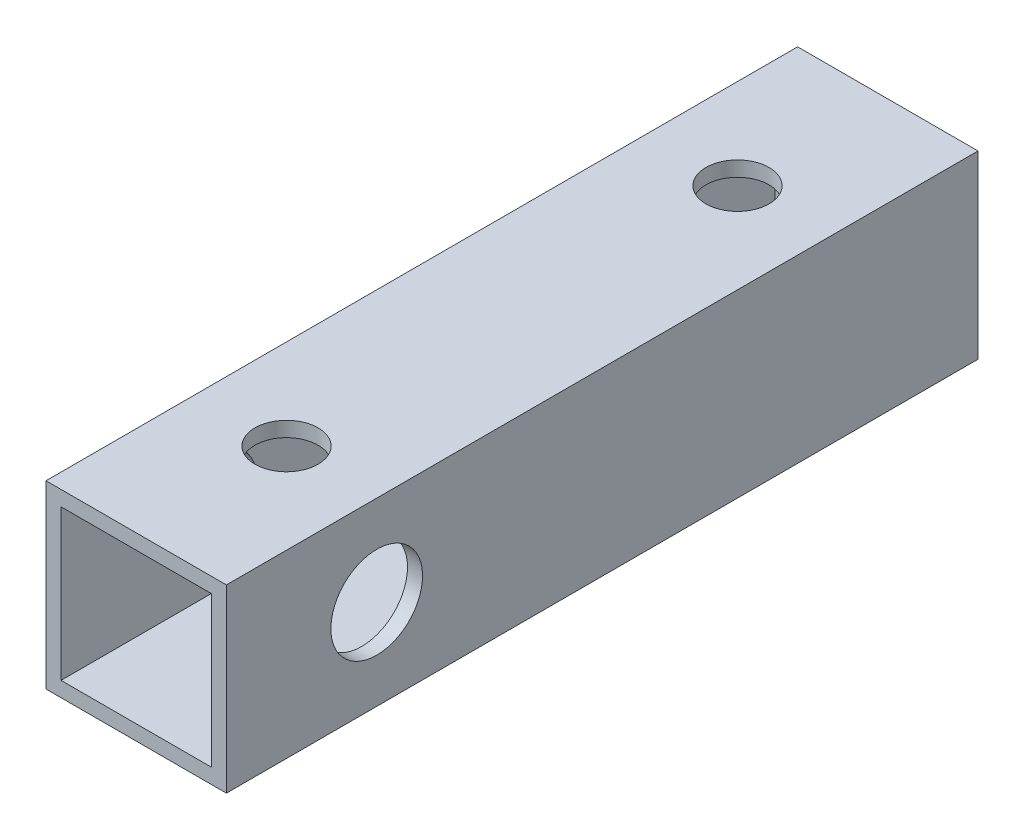
ISO-10303-21;
HEADER;
FILE_DESCRIPTION(('STEP AP214'),'2;1');
FILE_NAME('part.step','',(''),(''),'','','');
FILE_SCHEMA(('AUTOMOTIVE_DESIGN { 1 0 10303 214 1 1 1 1 }'));
ENDSEC;
DATA;
#1=APPLICATION_CONTEXT('core data for automotive mechanical design processes');
#2=APPLICATION_PROTOCOL_DEFINITION('international standard','automotive_design',2000,#1);
#3=PRODUCT_CONTEXT('',#1,'mechanical');
#4=PRODUCT('Part','Part','',(#3));
#5=PRODUCT_RELATED_PRODUCT_CATEGORY('part','',(#4));
#6=PRODUCT_DEFINITION_FORMATION('','',#4);
#7=PRODUCT_DEFINITION_CONTEXT('part definition',#1,'design');
#8=PRODUCT_DEFINITION('design','',#6,#7);
#9=PRODUCT_DEFINITION_SHAPE('','',#8);
#10=(LENGTH_UNIT() NAMED_UNIT(*) SI_UNIT(.MILLI.,.METRE.));
#11=(NAMED_UNIT(*) PLANE_ANGLE_UNIT() SI_UNIT($,.RADIAN.));
#12=(NAMED_UNIT(*) SI_UNIT($,.STERADIAN.) SOLID_ANGLE_UNIT());
#13=UNCERTAINTY_MEASURE_WITH_UNIT(LENGTH_MEASURE(1.E-05),#10,'distance_accuracy_value','');
#14=(GEOMETRIC_REPRESENTATION_CONTEXT(3) GLOBAL_UNCERTAINTY_ASSIGNED_CONTEXT((#13)) GLOBAL_UNIT_ASSIGNED_CONTEXT((#10,
#11,#12)) REPRESENTATION_CONTEXT('',''));
#15=CARTESIAN_POINT('',(0.,0.,0.));
#16=DIRECTION('',(0.,0.,1.));
#17=DIRECTION('',(1.,0.,0.));
#18=AXIS2_PLACEMENT_3D('',#15,#16,#17);
#19=CARTESIAN_POINT('',(6.,6.,50.));
#20=DIRECTION('',(-1.,0.,0.));
#21=DIRECTION('',(0.,-1.,0.));
#22=AXIS2_PLACEMENT_3D('',#19,#20,#21);
#23=PLANE('',#22);
#24=CARTESIAN_POINT('',(6.,0.,40.));
#25=DIRECTION('',(-1.,0.,0.));
#26=DIRECTION('',(0.,-1.,0.));
#27=AXIS2_PLACEMENT_3D('',#24,#25,#26);
#28=CIRCLE('',#27,3.05);
#29=CARTESIAN_POINT('',(6.,-3.05,40.));
#30=VERTEX_POINT('',#29);
#31=EDGE_CURVE('E190',#30,#30,#28,.T.);
#32=ORIENTED_EDGE('',*,*,#31,.T.);
#33=EDGE_LOOP('',(#32));
#34=FACE_BOUND('',#33,.T.);
#35=DIRECTION('',(0.,1.,0.));
#36=VECTOR('',#35,1.);
#37=CARTESIAN_POINT('',(6.,6.,0.));
#38=LINE('',#37,#36);
#39=CARTESIAN_POINT('',(6.,-6.,0.));
#40=VERTEX_POINT('',#39);
#41=CARTESIAN_POINT('',(6.,6.,0.));
#42=VERTEX_POINT('',#41);
#43=EDGE_CURVE('E146',#40,#42,#38,.T.);
#44=ORIENTED_EDGE('',*,*,#43,.T.);
#45=DIRECTION('',(0.,0.,-1.));
#46=VECTOR('',#45,1.);
#47=CARTESIAN_POINT('',(6.,6.,50.));
#48=LINE('',#47,#46);
#49=CARTESIAN_POINT('',(6.,6.,50.));
#50=VERTEX_POINT('',#49);
#51=EDGE_CURVE('E11',#50,#42,#48,.T.);
#52=ORIENTED_EDGE('',*,*,#51,.F.);
#53=DIRECTION('',(0.,1.,0.));
#54=VECTOR('',#53,1.);
#55=CARTESIAN_POINT('',(6.,6.,50.));
#56=LINE('',#55,#54);
#57=CARTESIAN_POINT('',(6.,-6.,50.));
#58=VERTEX_POINT('',#57);
#59=EDGE_CURVE('E150',#58,#50,#56,.T.);
#60=ORIENTED_EDGE('',*,*,#59,.F.);
#61=DIRECTION('',(0.,0.,-1.));
#62=VECTOR('',#61,1.);
#63=CARTESIAN_POINT('',(6.,-6.,50.));
#64=LINE('',#63,#62);
#65=EDGE_CURVE('E156',#58,#40,#64,.T.);
#66=ORIENTED_EDGE('',*,*,#65,.T.);
#67=EDGE_LOOP('',(#44,#52,#60,#66));
#68=FACE_BOUND('',#67,.T.);
#69=ADVANCED_FACE('F33',(#34,#68),#23,.F.);
#70=CARTESIAN_POINT('',(-6.,6.,50.));
#71=DIRECTION('',(0.,-1.,0.));
#72=DIRECTION('',(0.,0.,-1.));
#73=AXIS2_PLACEMENT_3D('',#70,#71,#72);
#74=PLANE('',#73);
#75=CARTESIAN_POINT('',(0.,6.,10.));
#76=DIRECTION('',(0.,1.,0.));
#77=DIRECTION('',(0.,0.,1.));
#78=AXIS2_PLACEMENT_3D('',#75,#76,#77);
#79=CIRCLE('',#78,2.1);
#80=CARTESIAN_POINT('',(0.,6.,12.1));
#81=VERTEX_POINT('',#80);
#82=EDGE_CURVE('E172',#81,#81,#79,.T.);
#83=ORIENTED_EDGE('',*,*,#82,.F.);
#84=EDGE_LOOP('',(#83));
#85=FACE_BOUND('',#84,.T.);
#86=CARTESIAN_POINT('',(0.,6.,40.));
#87=DIRECTION('',(0.,1.,0.));
#88=DIRECTION('',(0.,0.,1.));
#89=AXIS2_PLACEMENT_3D('',#86,#87,#88);
#90=CIRCLE('',#89,2.1);
#91=CARTESIAN_POINT('',(0.,6.,42.1));
#92=VERTEX_POINT('',#91);
#93=EDGE_CURVE('E187',#92,#92,#90,.T.);
#94=ORIENTED_EDGE('',*,*,#93,.F.);
#95=EDGE_LOOP('',(#94));
#96=FACE_BOUND('',#95,.T.);
#97=DIRECTION('',(-1.,0.,0.));
#98=VECTOR('',#97,1.);
#99=CARTESIAN_POINT('',(-6.,6.,0.));
#100=LINE('',#99,#98);
#101=CARTESIAN_POINT('',(-6.,6.,0.));
#102=VERTEX_POINT('',#101);
#103=EDGE_CURVE('E159',#42,#102,#100,.T.);
#104=ORIENTED_EDGE('',*,*,#103,.T.);
#105=DIRECTION('',(0.,0.,-1.));
#106=VECTOR('',#105,1.);
#107=CARTESIAN_POINT('',(-6.,6.,50.));
#108=LINE('',#107,#106);
#109=CARTESIAN_POINT('',(-6.,6.,50.));
#110=VERTEX_POINT('',#109);
#111=EDGE_CURVE('E41',#110,#102,#108,.T.);
#112=ORIENTED_EDGE('',*,*,#111,.F.);
#113=DIRECTION('',(-1.,0.,0.));
#114=VECTOR('',#113,1.);
#115=CARTESIAN_POINT('',(-6.,6.,50.));
#116=LINE('',#115,#114);
#117=EDGE_CURVE('E86',#50,#110,#116,.T.);
#118=ORIENTED_EDGE('',*,*,#117,.F.);
#119=ORIENTED_EDGE('',*,*,#51,.T.);
#120=EDGE_LOOP('',(#104,#112,#118,#119));
#121=FACE_BOUND('',#120,.T.);
#122=ADVANCED_FACE('F223',(#85,#96,#121),#74,.F.);
#123=CARTESIAN_POINT('',(-6.,6.,50.));
#124=DIRECTION('',(1.,0.,0.));
#125=DIRECTION('',(0.,1.,0.));
#126=AXIS2_PLACEMENT_3D('',#123,#124,#125);
#127=PLANE('',#126);
#128=CARTESIAN_POINT('',(-6.,0.,40.));
#129=DIRECTION('',(-1.,0.,0.));
#130=DIRECTION('',(0.,-1.,0.));
#131=AXIS2_PLACEMENT_3D('',#128,#129,#130);
#132=CIRCLE('',#131,3.05);
#133=CARTESIAN_POINT('',(-6.,-3.05,40.));
#134=VERTEX_POINT('',#133);
#135=EDGE_CURVE('E198',#134,#134,#132,.T.);
#136=ORIENTED_EDGE('',*,*,#135,.F.);
#137=EDGE_LOOP('',(#136));
#138=FACE_BOUND('',#137,.T.);
#139=DIRECTION('',(0.,-1.,0.));
#140=VECTOR('',#139,1.);
#141=CARTESIAN_POINT('',(-6.,6.,0.));
#142=LINE('',#141,#140);
#143=CARTESIAN_POINT('',(-6.,-6.,0.));
#144=VERTEX_POINT('',#143);
#145=EDGE_CURVE('E161',#102,#144,#142,.T.);
#146=ORIENTED_EDGE('',*,*,#145,.T.);
#147=DIRECTION('',(0.,0.,-1.));
#148=VECTOR('',#147,1.);
#149=CARTESIAN_POINT('',(-6.,-6.,50.));
#150=LINE('',#149,#148);
#151=CARTESIAN_POINT('',(-6.,-6.,50.));
#152=VERTEX_POINT('',#151);
#153=EDGE_CURVE('E165',#152,#144,#150,.T.);
#154=ORIENTED_EDGE('',*,*,#153,.F.);
#155=DIRECTION('',(0.,-1.,0.));
#156=VECTOR('',#155,1.);
#157=CARTESIAN_POINT('',(-6.,6.,50.));
#158=LINE('',#157,#156);
#159=EDGE_CURVE('E153',#110,#152,#158,.T.);
#160=ORIENTED_EDGE('',*,*,#159,.F.);
#161=ORIENTED_EDGE('',*,*,#111,.T.);
#162=EDGE_LOOP('',(#146,#154,#160,#161));
#163=FACE_BOUND('',#162,.T.);
#164=ADVANCED_FACE('F228',(#138,#163),#127,.F.);
#165=CARTESIAN_POINT('',(-6.,-6.,50.));
#166=DIRECTION('',(0.,1.,0.));
#167=DIRECTION('',(0.,0.,1.));
#168=AXIS2_PLACEMENT_3D('',#165,#166,#167);
#169=PLANE('',#168);
#170=CARTESIAN_POINT('',(0.,-6.,10.));
#171=DIRECTION('',(0.,1.,0.));
#172=DIRECTION('',(0.,0.,1.));
#173=AXIS2_PLACEMENT_3D('',#170,#171,#172);
#174=CIRCLE('',#173,2.1);
#175=CARTESIAN_POINT('',(0.,-6.,12.1));
#176=VERTEX_POINT('',#175);
#177=EDGE_CURVE('E134',#176,#176,#174,.T.);
#178=ORIENTED_EDGE('',*,*,#177,.T.);
#179=EDGE_LOOP('',(#178));
#180=FACE_BOUND('',#179,.T.);
#181=CARTESIAN_POINT('',(0.,-6.,40.));
#182=DIRECTION('',(0.,1.,0.));
#183=DIRECTION('',(0.,0.,1.));
#184=AXIS2_PLACEMENT_3D('',#181,#182,#183);
#185=CIRCLE('',#184,2.1);
#186=CARTESIAN_POINT('',(0.,-6.,42.1));
#187=VERTEX_POINT('',#186);
#188=EDGE_CURVE('E176',#187,#187,#185,.T.);
#189=ORIENTED_EDGE('',*,*,#188,.T.);
#190=EDGE_LOOP('',(#189));
#191=FACE_BOUND('',#190,.T.);
#192=DIRECTION('',(1.,0.,0.));
#193=VECTOR('',#192,1.);
#194=CARTESIAN_POINT('',(-6.,-6.,0.));
#195=LINE('',#194,#193);
#196=EDGE_CURVE('E79',#144,#40,#195,.T.);
#197=ORIENTED_EDGE('',*,*,#196,.T.);
#198=ORIENTED_EDGE('',*,*,#65,.F.);
#199=DIRECTION('',(1.,0.,0.));
#200=VECTOR('',#199,1.);
#201=CARTESIAN_POINT('',(-6.,-6.,50.));
#202=LINE('',#201,#200);
#203=EDGE_CURVE('E58',#152,#58,#202,.T.);
#204=ORIENTED_EDGE('',*,*,#203,.F.);
#205=ORIENTED_EDGE('',*,*,#153,.T.);
#206=EDGE_LOOP('',(#197,#198,#204,#205));
#207=FACE_BOUND('',#206,.T.);
#208=ADVANCED_FACE('F243',(#180,#191,#207),#169,.F.);
#209=CARTESIAN_POINT('',(0.,0.,50.));
#210=DIRECTION('',(0.,0.,1.));
#211=DIRECTION('',(1.,0.,0.));
#212=AXIS2_PLACEMENT_3D('',#209,#210,#211);
#213=PLANE('',#212);
#214=DIRECTION('',(0.,1.,0.));
#215=VECTOR('',#214,1.);
#216=CARTESIAN_POINT('',(5.,5.,50.));
#217=LINE('',#216,#215);
#218=CARTESIAN_POINT('',(5.,-5.,50.));
#219=VERTEX_POINT('',#218);
#220=CARTESIAN_POINT('',(5.,5.,50.));
#221=VERTEX_POINT('',#220);
#222=EDGE_CURVE('E49',#219,#221,#217,.T.);
#223=ORIENTED_EDGE('',*,*,#222,.F.);
#224=DIRECTION('',(1.,0.,0.));
#225=VECTOR('',#224,1.);
#226=CARTESIAN_POINT('',(-5.,-5.,50.));
#227=LINE('',#226,#225);
#228=CARTESIAN_POINT('',(-5.,-5.,50.));
#229=VERTEX_POINT('',#228);
#230=EDGE_CURVE('E128',#229,#219,#227,.T.);
#231=ORIENTED_EDGE('',*,*,#230,.F.);
#232=DIRECTION('',(0.,-1.,0.));
#233=VECTOR('',#232,1.);
#234=CARTESIAN_POINT('',(-5.,5.,50.));
#235=LINE('',#234,#233);
#236=CARTESIAN_POINT('',(-5.,5.,50.));
#237=VERTEX_POINT('',#236);
#238=EDGE_CURVE('E131',#237,#229,#235,.T.);
#239=ORIENTED_EDGE('',*,*,#238,.F.);
#240=DIRECTION('',(-1.,0.,0.));
#241=VECTOR('',#240,1.);
#242=CARTESIAN_POINT('',(-5.,5.,50.));
#243=LINE('',#242,#241);
#244=EDGE_CURVE('E140',#221,#237,#243,.T.);
#245=ORIENTED_EDGE('',*,*,#244,.F.);
#246=EDGE_LOOP('',(#223,#231,#239,#245));
#247=FACE_BOUND('',#246,.T.);
#248=ORIENTED_EDGE('',*,*,#59,.T.);
#249=ORIENTED_EDGE('',*,*,#117,.T.);
#250=ORIENTED_EDGE('',*,*,#159,.T.);
#251=ORIENTED_EDGE('',*,*,#203,.T.);
#252=EDGE_LOOP('',(#248,#249,#250,#251));
#253=FACE_BOUND('',#252,.T.);
#254=ADVANCED_FACE('F241',(#247,#253),#213,.T.);
#255=CARTESIAN_POINT('',(0.,0.,0.));
#256=DIRECTION('',(0.,0.,1.));
#257=DIRECTION('',(1.,0.,0.));
#258=AXIS2_PLACEMENT_3D('',#255,#256,#257);
#259=PLANE('',#258);
#260=ORIENTED_EDGE('',*,*,#43,.F.);
#261=ORIENTED_EDGE('',*,*,#196,.F.);
#262=ORIENTED_EDGE('',*,*,#145,.F.);
#263=ORIENTED_EDGE('',*,*,#103,.F.);
#264=EDGE_LOOP('',(#260,#261,#262,#263));
#265=FACE_BOUND('',#264,.T.);
#266=ADVANCED_FACE('F236',(#265),#259,.F.);
#267=CARTESIAN_POINT('',(5.,5.,2.5));
#268=DIRECTION('',(1.,0.,0.));
#269=DIRECTION('',(0.,0.,-1.));
#270=AXIS2_PLACEMENT_3D('',#267,#268,#269);
#271=PLANE('',#270);
#272=CARTESIAN_POINT('',(5.,0.,40.));
#273=DIRECTION('',(1.,0.,0.));
#274=DIRECTION('',(0.,0.,-1.));
#275=AXIS2_PLACEMENT_3D('',#272,#273,#274);
#276=CIRCLE('',#275,3.05);
#277=CARTESIAN_POINT('',(5.,0.,36.95));
#278=VERTEX_POINT('',#277);
#279=EDGE_CURVE('E195',#278,#278,#276,.T.);
#280=ORIENTED_EDGE('',*,*,#279,.T.);
#281=EDGE_LOOP('',(#280));
#282=FACE_BOUND('',#281,.T.);
#283=ORIENTED_EDGE('',*,*,#222,.T.);
#284=DIRECTION('',(0.,0.,1.));
#285=VECTOR('',#284,1.);
#286=CARTESIAN_POINT('',(5.,5.,2.5));
#287=LINE('',#286,#285);
#288=CARTESIAN_POINT('',(5.,5.,2.5));
#289=VERTEX_POINT('',#288);
#290=EDGE_CURVE('E106',#289,#221,#287,.T.);
#291=ORIENTED_EDGE('',*,*,#290,.F.);
#292=DIRECTION('',(0.,1.,0.));
#293=VECTOR('',#292,1.);
#294=CARTESIAN_POINT('',(5.,5.,2.5));
#295=LINE('',#294,#293);
#296=CARTESIAN_POINT('',(5.,-5.,2.5));
#297=VERTEX_POINT('',#296);
#298=EDGE_CURVE('E110',#297,#289,#295,.T.);
#299=ORIENTED_EDGE('',*,*,#298,.F.);
#300=DIRECTION('',(0.,0.,1.));
#301=VECTOR('',#300,1.);
#302=CARTESIAN_POINT('',(5.,-5.,2.5));
#303=LINE('',#302,#301);
#304=EDGE_CURVE('E144',#297,#219,#303,.T.);
#305=ORIENTED_EDGE('',*,*,#304,.T.);
#306=EDGE_LOOP('',(#283,#291,#299,#305));
#307=FACE_BOUND('',#306,.T.);
#308=ADVANCED_FACE('F108',(#282,#307),#271,.F.);
#309=CARTESIAN_POINT('',(-5.,-5.,2.5));
#310=DIRECTION('',(0.,-1.,0.));
#311=DIRECTION('',(0.,0.,-1.));
#312=AXIS2_PLACEMENT_3D('',#309,#310,#311);
#313=PLANE('',#312);
#314=CARTESIAN_POINT('',(0.,-5.,10.));
#315=DIRECTION('',(0.,-1.,0.));
#316=DIRECTION('',(0.,0.,-1.));
#317=AXIS2_PLACEMENT_3D('',#314,#315,#316);
#318=CIRCLE('',#317,2.1);
#319=CARTESIAN_POINT('',(0.,-5.,7.9));
#320=VERTEX_POINT('',#319);
#321=EDGE_CURVE('E175',#320,#320,#318,.T.);
#322=ORIENTED_EDGE('',*,*,#321,.T.);
#323=EDGE_LOOP('',(#322));
#324=FACE_BOUND('',#323,.T.);
#325=CARTESIAN_POINT('',(0.,-5.,40.));
#326=DIRECTION('',(0.,-1.,0.));
#327=DIRECTION('',(0.,0.,-1.));
#328=AXIS2_PLACEMENT_3D('',#325,#326,#327);
#329=CIRCLE('',#328,2.1);
#330=CARTESIAN_POINT('',(0.,-5.,37.9));
#331=VERTEX_POINT('',#330);
#332=EDGE_CURVE('E171',#331,#331,#329,.T.);
#333=ORIENTED_EDGE('',*,*,#332,.T.);
#334=EDGE_LOOP('',(#333));
#335=FACE_BOUND('',#334,.T.);
#336=ORIENTED_EDGE('',*,*,#230,.T.);
#337=ORIENTED_EDGE('',*,*,#304,.F.);
#338=DIRECTION('',(1.,0.,0.));
#339=VECTOR('',#338,1.);
#340=CARTESIAN_POINT('',(-5.,-5.,2.5));
#341=LINE('',#340,#339);
#342=CARTESIAN_POINT('',(-5.,-5.,2.5));
#343=VERTEX_POINT('',#342);
#344=EDGE_CURVE('E116',#343,#297,#341,.T.);
#345=ORIENTED_EDGE('',*,*,#344,.F.);
#346=DIRECTION('',(0.,0.,1.));
#347=VECTOR('',#346,1.);
#348=CARTESIAN_POINT('',(-5.,-5.,2.5));
#349=LINE('',#348,#347);
#350=EDGE_CURVE('E147',#343,#229,#349,.T.);
#351=ORIENTED_EDGE('',*,*,#350,.T.);
#352=EDGE_LOOP('',(#336,#337,#345,#351));
#353=FACE_BOUND('',#352,.T.);
#354=ADVANCED_FACE('F276',(#324,#335,#353),#313,.F.);
#355=CARTESIAN_POINT('',(-5.,5.,2.5));
#356=DIRECTION('',(-1.,0.,0.));
#357=DIRECTION('',(0.,-1.,0.));
#358=AXIS2_PLACEMENT_3D('',#355,#356,#357);
#359=PLANE('',#358);
#360=CARTESIAN_POINT('',(-5.,0.,40.));
#361=DIRECTION('',(-1.,0.,0.));
#362=DIRECTION('',(0.,-1.,0.));
#363=AXIS2_PLACEMENT_3D('',#360,#361,#362);
#364=CIRCLE('',#363,3.05);
#365=CARTESIAN_POINT('',(-5.,-3.05,40.));
#366=VERTEX_POINT('',#365);
#367=EDGE_CURVE('E36',#366,#366,#364,.T.);
#368=ORIENTED_EDGE('',*,*,#367,.T.);
#369=EDGE_LOOP('',(#368));
#370=FACE_BOUND('',#369,.T.);
#371=ORIENTED_EDGE('',*,*,#238,.T.);
#372=ORIENTED_EDGE('',*,*,#350,.F.);
#373=DIRECTION('',(0.,-1.,0.));
#374=VECTOR('',#373,1.);
#375=CARTESIAN_POINT('',(-5.,5.,2.5));
#376=LINE('',#375,#374);
#377=CARTESIAN_POINT('',(-5.,5.,2.5));
#378=VERTEX_POINT('',#377);
#379=EDGE_CURVE('E124',#378,#343,#376,.T.);
#380=ORIENTED_EDGE('',*,*,#379,.F.);
#381=DIRECTION('',(0.,0.,1.));
#382=VECTOR('',#381,1.);
#383=CARTESIAN_POINT('',(-5.,5.,2.5));
#384=LINE('',#383,#382);
#385=EDGE_CURVE('E115',#378,#237,#384,.T.);
#386=ORIENTED_EDGE('',*,*,#385,.T.);
#387=EDGE_LOOP('',(#371,#372,#380,#386));
#388=FACE_BOUND('',#387,.T.);
#389=ADVANCED_FACE('F205',(#370,#388),#359,.F.);
#390=CARTESIAN_POINT('',(-5.,5.,2.5));
#391=DIRECTION('',(0.,1.,0.));
#392=DIRECTION('',(0.,0.,1.));
#393=AXIS2_PLACEMENT_3D('',#390,#391,#392);
#394=PLANE('',#393);
#395=CARTESIAN_POINT('',(0.,5.,10.));
#396=DIRECTION('',(0.,1.,0.));
#397=DIRECTION('',(0.,0.,1.));
#398=AXIS2_PLACEMENT_3D('',#395,#396,#397);
#399=CIRCLE('',#398,2.1);
#400=CARTESIAN_POINT('',(0.,5.,12.1));
#401=VERTEX_POINT('',#400);
#402=EDGE_CURVE('E173',#401,#401,#399,.T.);
#403=ORIENTED_EDGE('',*,*,#402,.T.);
#404=EDGE_LOOP('',(#403));
#405=FACE_BOUND('',#404,.T.);
#406=CARTESIAN_POINT('',(0.,5.,40.));
#407=DIRECTION('',(0.,1.,0.));
#408=DIRECTION('',(0.,0.,1.));
#409=AXIS2_PLACEMENT_3D('',#406,#407,#408);
#410=CIRCLE('',#409,2.1);
#411=CARTESIAN_POINT('',(0.,5.,42.1));
#412=VERTEX_POINT('',#411);
#413=EDGE_CURVE('E169',#412,#412,#410,.T.);
#414=ORIENTED_EDGE('',*,*,#413,.T.);
#415=EDGE_LOOP('',(#414));
#416=FACE_BOUND('',#415,.T.);
#417=ORIENTED_EDGE('',*,*,#244,.T.);
#418=ORIENTED_EDGE('',*,*,#385,.F.);
#419=DIRECTION('',(-1.,0.,0.));
#420=VECTOR('',#419,1.);
#421=CARTESIAN_POINT('',(-5.,5.,2.5));
#422=LINE('',#421,#420);
#423=EDGE_CURVE('E119',#289,#378,#422,.T.);
#424=ORIENTED_EDGE('',*,*,#423,.F.);
#425=ORIENTED_EDGE('',*,*,#290,.T.);
#426=EDGE_LOOP('',(#417,#418,#424,#425));
#427=FACE_BOUND('',#426,.T.);
#428=ADVANCED_FACE('F120',(#405,#416,#427),#394,.F.);
#429=CARTESIAN_POINT('',(0.,0.,2.5));
#430=DIRECTION('',(0.,0.,1.));
#431=DIRECTION('',(1.,0.,0.));
#432=AXIS2_PLACEMENT_3D('',#429,#430,#431);
#433=PLANE('',#432);
#434=ORIENTED_EDGE('',*,*,#298,.T.);
#435=ORIENTED_EDGE('',*,*,#423,.T.);
#436=ORIENTED_EDGE('',*,*,#379,.T.);
#437=ORIENTED_EDGE('',*,*,#344,.T.);
#438=EDGE_LOOP('',(#434,#435,#436,#437));
#439=FACE_BOUND('',#438,.T.);
#440=ADVANCED_FACE('F126',(#439),#433,.T.);
#441=CARTESIAN_POINT('',(0.,-41.5,40.));
#442=DIRECTION('',(0.,1.,0.));
#443=DIRECTION('',(0.,0.,1.));
#444=AXIS2_PLACEMENT_3D('',#441,#442,#443);
#445=CYLINDRICAL_SURFACE('',#444,2.1);
#446=ORIENTED_EDGE('',*,*,#93,.T.);
#447=EDGE_LOOP('',(#446));
#448=FACE_BOUND('',#447,.T.);
#449=ORIENTED_EDGE('',*,*,#413,.F.);
#450=EDGE_LOOP('',(#449));
#451=FACE_BOUND('',#450,.T.);
#452=ADVANCED_FACE('F299',(#448,#451),#445,.F.);
#453=CARTESIAN_POINT('',(0.,-41.5,10.));
#454=DIRECTION('',(0.,1.,0.));
#455=DIRECTION('',(0.,0.,1.));
#456=AXIS2_PLACEMENT_3D('',#453,#454,#455);
#457=CYLINDRICAL_SURFACE('',#456,2.1);
#458=ORIENTED_EDGE('',*,*,#82,.T.);
#459=EDGE_LOOP('',(#458));
#460=FACE_BOUND('',#459,.T.);
#461=ORIENTED_EDGE('',*,*,#402,.F.);
#462=EDGE_LOOP('',(#461));
#463=FACE_BOUND('',#462,.T.);
#464=ADVANCED_FACE('F221',(#460,#463),#457,.F.);
#465=ORIENTED_EDGE('',*,*,#332,.F.);
#466=EDGE_LOOP('',(#465));
#467=FACE_BOUND('',#466,.T.);
#468=ORIENTED_EDGE('',*,*,#188,.F.);
#469=EDGE_LOOP('',(#468));
#470=FACE_BOUND('',#469,.T.);
#471=ADVANCED_FACE('F218',(#467,#470),#445,.F.);
#472=ORIENTED_EDGE('',*,*,#321,.F.);
#473=EDGE_LOOP('',(#472));
#474=FACE_BOUND('',#473,.T.);
#475=ORIENTED_EDGE('',*,*,#177,.F.);
#476=EDGE_LOOP('',(#475));
#477=FACE_BOUND('',#476,.T.);
#478=ADVANCED_FACE('F211',(#474,#477),#457,.F.);
#479=CARTESIAN_POINT('',(41.5,0.,40.));
#480=DIRECTION('',(-1.,0.,0.));
#481=DIRECTION('',(0.,-1.,0.));
#482=AXIS2_PLACEMENT_3D('',#479,#480,#481);
#483=CYLINDRICAL_SURFACE('',#482,3.05);
#484=ORIENTED_EDGE('',*,*,#135,.T.);
#485=EDGE_LOOP('',(#484));
#486=FACE_BOUND('',#485,.T.);
#487=ORIENTED_EDGE('',*,*,#367,.F.);
#488=EDGE_LOOP('',(#487));
#489=FACE_BOUND('',#488,.T.);
#490=ADVANCED_FACE('F208',(#486,#489),#483,.F.);
#491=ORIENTED_EDGE('',*,*,#279,.F.);
#492=EDGE_LOOP('',(#491));
#493=FACE_BOUND('',#492,.T.);
#494=ORIENTED_EDGE('',*,*,#31,.F.);
#495=EDGE_LOOP('',(#494));
#496=FACE_BOUND('',#495,.T.);
#497=ADVANCED_FACE('F210',(#493,#496),#483,.F.);
#498=CLOSED_SHELL('',(#69,#122,#164,#208,#254,#266,#308,#354,#389,#428,#440,#452,#464,#471,#478,
#490,#497));
#499=MANIFOLD_SOLID_BREP('B2',#498);
#500=ADVANCED_BREP_SHAPE_REPRESENTATION('',(#18,#499),#14);
#501=SHAPE_DEFINITION_REPRESENTATION(#9,#500);
ENDSEC;
END-ISO-10303-21;
